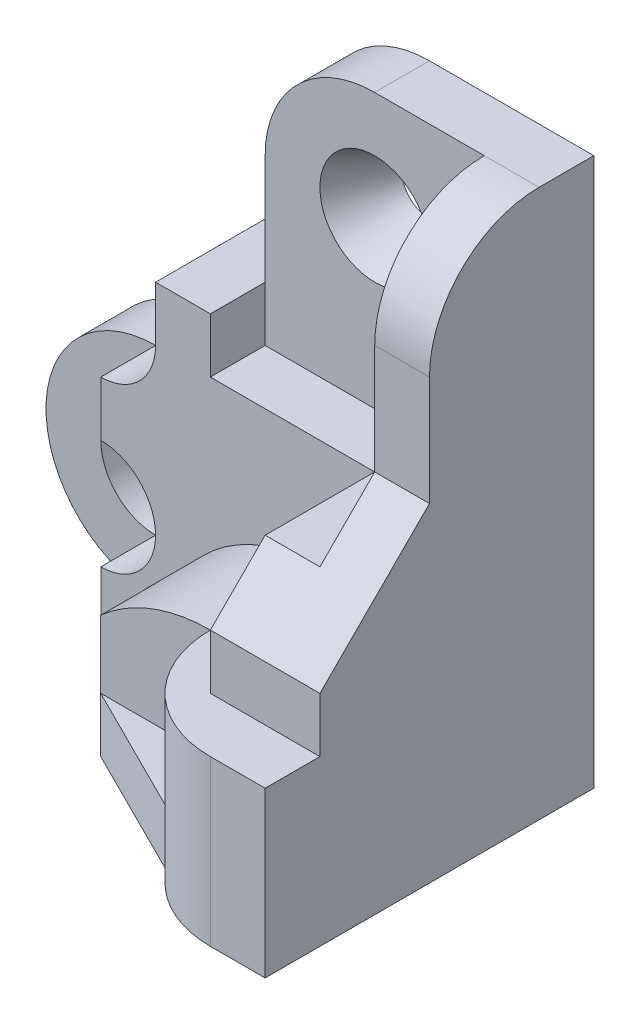
ISO-10303-21;
HEADER;
FILE_DESCRIPTION(('STEP AP214'),'2;1');
FILE_NAME('part.step','',(''),(''),'','','');
FILE_SCHEMA(('AUTOMOTIVE_DESIGN { 1 0 10303 214 1 1 1 1 }'));
ENDSEC;
DATA;
#1=APPLICATION_CONTEXT('core data for automotive mechanical design processes');
#2=APPLICATION_PROTOCOL_DEFINITION('international standard','automotive_design',2000,#1);
#3=PRODUCT_CONTEXT('',#1,'mechanical');
#4=PRODUCT('Part','Part','',(#3));
#5=PRODUCT_RELATED_PRODUCT_CATEGORY('part','',(#4));
#6=PRODUCT_DEFINITION_FORMATION('','',#4);
#7=PRODUCT_DEFINITION_CONTEXT('part definition',#1,'design');
#8=PRODUCT_DEFINITION('design','',#6,#7);
#9=PRODUCT_DEFINITION_SHAPE('','',#8);
#10=(LENGTH_UNIT() NAMED_UNIT(*) SI_UNIT(.MILLI.,.METRE.));
#11=(NAMED_UNIT(*) PLANE_ANGLE_UNIT() SI_UNIT($,.RADIAN.));
#12=(NAMED_UNIT(*) SI_UNIT($,.STERADIAN.) SOLID_ANGLE_UNIT());
#13=UNCERTAINTY_MEASURE_WITH_UNIT(LENGTH_MEASURE(1.E-05),#10,'distance_accuracy_value','');
#14=(GEOMETRIC_REPRESENTATION_CONTEXT(3) GLOBAL_UNCERTAINTY_ASSIGNED_CONTEXT((#13)) GLOBAL_UNIT_ASSIGNED_CONTEXT((#10,
#11,#12)) REPRESENTATION_CONTEXT('',''));
#15=CARTESIAN_POINT('',(0.,0.,0.));
#16=DIRECTION('',(0.,0.,1.));
#17=DIRECTION('',(1.,0.,0.));
#18=AXIS2_PLACEMENT_3D('',#15,#16,#17);
#19=CARTESIAN_POINT('',(4.,0.,6.));
#20=DIRECTION('',(0.,0.,-1.));
#21=DIRECTION('',(-1.,0.,0.));
#22=AXIS2_PLACEMENT_3D('',#19,#20,#21);
#23=CYLINDRICAL_SURFACE('',#22,3.);
#24=CARTESIAN_POINT('',(4.,0.,2.99528394795731));
#25=DIRECTION('',(0.,0.,1.));
#26=DIRECTION('',(1.,0.,0.));
#27=AXIS2_PLACEMENT_3D('',#24,#25,#26);
#28=CIRCLE('',#27,3.);
#29=CARTESIAN_POINT('',(1.9987734834733,2.23497034198452,2.99528394795731));
#30=VERTEX_POINT('',#29);
#31=CARTESIAN_POINT('',(0.999999999999999,0.,2.99528394795731));
#32=VERTEX_POINT('',#31);
#33=EDGE_CURVE('E433',#30,#32,#28,.T.);
#34=ORIENTED_EDGE('',*,*,#33,.F.);
#35=CARTESIAN_POINT('',(4.,0.,-1365.95293394664));
#36=DIRECTION('',(-0.99999893146743,0.,-0.00146187003422877));
#37=DIRECTION('',(0.00146187003422877,0.,-0.999998931467431));
#38=AXIS2_PLACEMENT_3D('',#35,#36,#37);
#39=ELLIPSE('',#38,2052.1660132275,3.);
#40=CARTESIAN_POINT('',(1.99730471761449,2.2336543165653,4.));
#41=VERTEX_POINT('',#40);
#42=EDGE_CURVE('E443',#41,#30,#39,.T.);
#43=ORIENTED_EDGE('',*,*,#42,.F.);
#44=CARTESIAN_POINT('',(4.,0.,4.));
#45=DIRECTION('',(0.,0.,-1.));
#46=DIRECTION('',(-1.,0.,0.));
#47=AXIS2_PLACEMENT_3D('',#44,#45,#46);
#48=CIRCLE('',#47,3.);
#49=CARTESIAN_POINT('',(4.,3.,4.));
#50=VERTEX_POINT('',#49);
#51=EDGE_CURVE('E274',#41,#50,#48,.T.);
#52=ORIENTED_EDGE('',*,*,#51,.T.);
#53=DIRECTION('',(0.,0.,-1.));
#54=VECTOR('',#53,1.);
#55=CARTESIAN_POINT('',(4.,3.,6.));
#56=LINE('',#55,#54);
#57=CARTESIAN_POINT('',(4.,3.,2.));
#58=VERTEX_POINT('',#57);
#59=EDGE_CURVE('E48',#50,#58,#56,.T.);
#60=ORIENTED_EDGE('',*,*,#59,.T.);
#61=CARTESIAN_POINT('',(4.,0.,2.));
#62=DIRECTION('',(0.,0.,1.));
#63=DIRECTION('',(1.,0.,0.));
#64=AXIS2_PLACEMENT_3D('',#61,#62,#63);
#65=CIRCLE('',#64,3.);
#66=CARTESIAN_POINT('',(0.999999999999999,0.,2.));
#67=VERTEX_POINT('',#66);
#68=EDGE_CURVE('E258',#58,#67,#65,.T.);
#69=ORIENTED_EDGE('',*,*,#68,.T.);
#70=DIRECTION('',(0.,0.,-1.));
#71=VECTOR('',#70,1.);
#72=CARTESIAN_POINT('',(0.999999999999999,0.,6.));
#73=LINE('',#72,#71);
#74=EDGE_CURVE('E249',#32,#67,#73,.T.);
#75=ORIENTED_EDGE('',*,*,#74,.F.);
#76=EDGE_LOOP('',(#34,#43,#52,#60,#69,#75));
#77=FACE_BOUND('',#76,.T.);
#78=ADVANCED_FACE('F33',(#77),#23,.T.);
#79=CARTESIAN_POINT('',(7.,0.,2.));
#80=DIRECTION('',(0.,1.,0.));
#81=DIRECTION('',(-1.,0.,0.));
#82=AXIS2_PLACEMENT_3D('',#79,#80,#81);
#83=PLANE('',#82);
#84=DIRECTION('',(1.,0.,0.));
#85=VECTOR('',#84,1.);
#86=CARTESIAN_POINT('',(7.,0.,2.99528394795731));
#87=LINE('',#86,#85);
#88=CARTESIAN_POINT('',(1.9987734834733,0.,2.99528394795731));
#89=VERTEX_POINT('',#88);
#90=EDGE_CURVE('E11',#32,#89,#87,.T.);
#91=ORIENTED_EDGE('',*,*,#90,.F.);
#92=ORIENTED_EDGE('',*,*,#74,.T.);
#93=DIRECTION('',(1.,0.,0.));
#94=VECTOR('',#93,1.);
#95=CARTESIAN_POINT('',(7.,0.,2.));
#96=LINE('',#95,#94);
#97=CARTESIAN_POINT('',(0.,0.,2.));
#98=VERTEX_POINT('',#97);
#99=EDGE_CURVE('E295',#98,#67,#96,.T.);
#100=ORIENTED_EDGE('',*,*,#99,.F.);
#101=DIRECTION('',(0.,0.,-1.));
#102=VECTOR('',#101,1.);
#103=CARTESIAN_POINT('',(0.,0.,2.));
#104=LINE('',#103,#102);
#105=CARTESIAN_POINT('',(0.,0.,1.));
#106=VERTEX_POINT('',#105);
#107=EDGE_CURVE('E361',#98,#106,#104,.T.);
#108=ORIENTED_EDGE('',*,*,#107,.T.);
#109=CARTESIAN_POINT('',(0.,0.,0.));
#110=VERTEX_POINT('',#109);
#111=EDGE_CURVE('E360',#106,#110,#104,.T.);
#112=ORIENTED_EDGE('',*,*,#111,.T.);
#113=DIRECTION('',(1.,0.,0.));
#114=VECTOR('',#113,1.);
#115=CARTESIAN_POINT('',(7.,0.,0.));
#116=LINE('',#115,#114);
#117=CARTESIAN_POINT('',(7.,0.,0.));
#118=VERTEX_POINT('',#117);
#119=EDGE_CURVE('E319',#110,#118,#116,.T.);
#120=ORIENTED_EDGE('',*,*,#119,.T.);
#121=DIRECTION('',(0.,0.,-1.));
#122=VECTOR('',#121,1.);
#123=CARTESIAN_POINT('',(7.,0.,2.));
#124=LINE('',#123,#122);
#125=CARTESIAN_POINT('',(7.,0.,6.));
#126=VERTEX_POINT('',#125);
#127=EDGE_CURVE('E247',#126,#118,#124,.T.);
#128=ORIENTED_EDGE('',*,*,#127,.F.);
#129=DIRECTION('',(1.,0.,0.));
#130=VECTOR('',#129,1.);
#131=CARTESIAN_POINT('',(0.999999999999999,0.,6.));
#132=LINE('',#131,#130);
#133=CARTESIAN_POINT('',(6.,0.,6.));
#134=VERTEX_POINT('',#133);
#135=EDGE_CURVE('E225',#134,#126,#132,.T.);
#136=ORIENTED_EDGE('',*,*,#135,.F.);
#137=CARTESIAN_POINT('',(6.,0.,4.));
#138=DIRECTION('',(0.,1.,0.));
#139=DIRECTION('',(-1.,0.,0.));
#140=AXIS2_PLACEMENT_3D('',#137,#138,#139);
#141=CIRCLE('',#140,2.);
#142=CARTESIAN_POINT('',(4.40064675143027,0.,5.20086185145897));
#143=VERTEX_POINT('',#142);
#144=EDGE_CURVE('E235',#143,#134,#141,.T.);
#145=ORIENTED_EDGE('',*,*,#144,.F.);
#146=DIRECTION('',(0.894547630294076,0.,0.44697263577903));
#147=VECTOR('',#146,1.);
#148=CARTESIAN_POINT('',(5.20086221429504,0.,5.60070016360141));
#149=LINE('',#148,#147);
#150=CARTESIAN_POINT('',(1.99730471761449,0.,4.));
#151=VERTEX_POINT('',#150);
#152=EDGE_CURVE('E241',#151,#143,#149,.T.);
#153=ORIENTED_EDGE('',*,*,#152,.F.);
#154=DIRECTION('',(-0.00146187003422877,0.,0.999998931467431));
#155=VECTOR('',#154,1.);
#156=CARTESIAN_POINT('',(2.00023914563881,0.,1.99269099161879));
#157=LINE('',#156,#155);
#158=EDGE_CURVE('E863',#89,#151,#157,.T.);
#159=ORIENTED_EDGE('',*,*,#158,.F.);
#160=EDGE_LOOP('',(#91,#92,#100,#108,#112,#120,#128,#136,#145,#153,#159));
#161=FACE_BOUND('',#160,.T.);
#162=ADVANCED_FACE('F245',(#161),#83,.F.);
#163=CARTESIAN_POINT('',(0.,0.999999999999999,0.));
#164=DIRECTION('',(0.,1.,0.));
#165=DIRECTION('',(0.,0.,1.));
#166=AXIS2_PLACEMENT_3D('',#163,#164,#165);
#167=PLANE('',#166);
#168=DIRECTION('',(-1.,0.,0.));
#169=VECTOR('',#168,1.);
#170=CARTESIAN_POINT('',(0.,0.999999999999999,4.));
#171=LINE('',#170,#169);
#172=CARTESIAN_POINT('',(4.,0.999999999999999,4.));
#173=VERTEX_POINT('',#172);
#174=CARTESIAN_POINT('',(1.99730471761449,0.999999999999999,4.));
#175=VERTEX_POINT('',#174);
#176=EDGE_CURVE('E231',#173,#175,#171,.T.);
#177=ORIENTED_EDGE('',*,*,#176,.T.);
#178=DIRECTION('',(0.894547630294076,0.,0.44697263577903));
#179=VECTOR('',#178,1.);
#180=CARTESIAN_POINT('',(-1.20032265004305,0.999999999999999,2.4022629043339));
#181=LINE('',#180,#179);
#182=CARTESIAN_POINT('',(4.40064675143027,0.999999999999999,5.20086185145897));
#183=VERTEX_POINT('',#182);
#184=EDGE_CURVE('E41',#175,#183,#181,.T.);
#185=ORIENTED_EDGE('',*,*,#184,.T.);
#186=CARTESIAN_POINT('',(6.,0.999999999999999,4.));
#187=DIRECTION('',(0.,1.,0.));
#188=DIRECTION('',(0.,0.,1.));
#189=AXIS2_PLACEMENT_3D('',#186,#187,#188);
#190=CIRCLE('',#189,2.);
#191=EDGE_CURVE('E440',#183,#173,#190,.F.);
#192=ORIENTED_EDGE('',*,*,#191,.T.);
#193=EDGE_LOOP('',(#177,#185,#192));
#194=FACE_BOUND('',#193,.T.);
#195=ADVANCED_FACE('F550',(#194),#167,.T.);
#196=CARTESIAN_POINT('',(4.,0.,6.));
#197=DIRECTION('',(0.,0.,1.));
#198=DIRECTION('',(1.,0.,0.));
#199=AXIS2_PLACEMENT_3D('',#196,#197,#198);
#200=PLANE('',#199);
#201=DIRECTION('',(0.,1.,0.));
#202=VECTOR('',#201,1.);
#203=CARTESIAN_POINT('',(6.,0.999999999999999,6.));
#204=LINE('',#203,#202);
#205=CARTESIAN_POINT('',(6.,3.,6.));
#206=VERTEX_POINT('',#205);
#207=EDGE_CURVE('E220',#134,#206,#204,.T.);
#208=ORIENTED_EDGE('',*,*,#207,.F.);
#209=ORIENTED_EDGE('',*,*,#135,.T.);
#210=DIRECTION('',(0.,1.,0.));
#211=VECTOR('',#210,1.);
#212=CARTESIAN_POINT('',(7.,0.,6.));
#213=LINE('',#212,#211);
#214=CARTESIAN_POINT('',(7.,3.,6.));
#215=VERTEX_POINT('',#214);
#216=EDGE_CURVE('E251',#126,#215,#213,.T.);
#217=ORIENTED_EDGE('',*,*,#216,.T.);
#218=DIRECTION('',(-1.,0.,0.));
#219=VECTOR('',#218,1.);
#220=CARTESIAN_POINT('',(5.,3.,6.));
#221=LINE('',#220,#219);
#222=EDGE_CURVE('E227',#215,#206,#221,.T.);
#223=ORIENTED_EDGE('',*,*,#222,.T.);
#224=EDGE_LOOP('',(#208,#209,#217,#223));
#225=FACE_BOUND('',#224,.T.);
#226=ADVANCED_FACE('F222',(#225),#200,.T.);
#227=CARTESIAN_POINT('',(4.,10.,2.));
#228=DIRECTION('',(0.,-1.,0.));
#229=DIRECTION('',(0.,0.,-1.));
#230=AXIS2_PLACEMENT_3D('',#227,#228,#229);
#231=PLANE('',#230);
#232=DIRECTION('',(1.,0.,0.));
#233=VECTOR('',#232,1.);
#234=CARTESIAN_POINT('',(3.,10.,1.));
#235=LINE('',#234,#233);
#236=CARTESIAN_POINT('',(6.,10.,1.));
#237=VERTEX_POINT('',#236);
#238=CARTESIAN_POINT('',(7.,10.,1.));
#239=VERTEX_POINT('',#238);
#240=EDGE_CURVE('E463',#237,#239,#235,.T.);
#241=ORIENTED_EDGE('',*,*,#240,.T.);
#242=DIRECTION('',(0.,0.,-1.));
#243=VECTOR('',#242,1.);
#244=CARTESIAN_POINT('',(7.,10.,2.));
#245=LINE('',#244,#243);
#246=CARTESIAN_POINT('',(7.,10.,0.));
#247=VERTEX_POINT('',#246);
#248=EDGE_CURVE('E357',#239,#247,#245,.T.);
#249=ORIENTED_EDGE('',*,*,#248,.T.);
#250=DIRECTION('',(-1.,0.,0.));
#251=VECTOR('',#250,1.);
#252=CARTESIAN_POINT('',(4.,10.,0.));
#253=LINE('',#252,#251);
#254=CARTESIAN_POINT('',(4.,10.,0.));
#255=VERTEX_POINT('',#254);
#256=EDGE_CURVE('E325',#247,#255,#253,.T.);
#257=ORIENTED_EDGE('',*,*,#256,.T.);
#258=DIRECTION('',(0.,0.,-1.));
#259=VECTOR('',#258,1.);
#260=CARTESIAN_POINT('',(4.,10.,2.));
#261=LINE('',#260,#259);
#262=CARTESIAN_POINT('',(4.,10.,1.));
#263=VERTEX_POINT('',#262);
#264=EDGE_CURVE('E355',#263,#255,#261,.T.);
#265=ORIENTED_EDGE('',*,*,#264,.F.);
#266=DIRECTION('',(-1.,0.,0.));
#267=VECTOR('',#266,1.);
#268=CARTESIAN_POINT('',(6.,10.,1.));
#269=LINE('',#268,#267);
#270=EDGE_CURVE('E404',#237,#263,#269,.T.);
#271=ORIENTED_EDGE('',*,*,#270,.F.);
#272=EDGE_LOOP('',(#241,#249,#257,#265,#271));
#273=FACE_BOUND('',#272,.T.);
#274=ADVANCED_FACE('F518',(#273),#231,.F.);
#275=CARTESIAN_POINT('',(0.,2.,2.));
#276=DIRECTION('',(0.,0.,-1.));
#277=DIRECTION('',(-1.,0.,0.));
#278=AXIS2_PLACEMENT_3D('',#275,#276,#277);
#279=PLANE('',#278);
#280=ORIENTED_EDGE('',*,*,#68,.F.);
#281=DIRECTION('',(-1.,0.,0.));
#282=VECTOR('',#281,1.);
#283=CARTESIAN_POINT('',(5.,3.,2.));
#284=LINE('',#283,#282);
#285=CARTESIAN_POINT('',(5.,3.,2.));
#286=VERTEX_POINT('',#285);
#287=EDGE_CURVE('E255',#286,#58,#284,.T.);
#288=ORIENTED_EDGE('',*,*,#287,.F.);
#289=DIRECTION('',(0.,-1.,0.));
#290=VECTOR('',#289,1.);
#291=CARTESIAN_POINT('',(5.,5.,2.));
#292=LINE('',#291,#290);
#293=CARTESIAN_POINT('',(5.,5.,2.));
#294=VERTEX_POINT('',#293);
#295=EDGE_CURVE('E259',#294,#286,#292,.T.);
#296=ORIENTED_EDGE('',*,*,#295,.F.);
#297=DIRECTION('',(1.,0.,0.));
#298=VECTOR('',#297,1.);
#299=CARTESIAN_POINT('',(6.,5.,2.));
#300=LINE('',#299,#298);
#301=CARTESIAN_POINT('',(2.,5.,2.));
#302=VERTEX_POINT('',#301);
#303=EDGE_CURVE('E301',#302,#294,#300,.T.);
#304=ORIENTED_EDGE('',*,*,#303,.F.);
#305=DIRECTION('',(0.,-1.,0.));
#306=VECTOR('',#305,1.);
#307=CARTESIAN_POINT('',(2.,10.,2.));
#308=LINE('',#307,#306);
#309=CARTESIAN_POINT('',(2.,6.,2.));
#310=VERTEX_POINT('',#309);
#311=EDGE_CURVE('E396',#310,#302,#308,.T.);
#312=ORIENTED_EDGE('',*,*,#311,.F.);
#313=DIRECTION('',(-1.,0.,0.));
#314=VECTOR('',#313,1.);
#315=CARTESIAN_POINT('',(0.999999999999999,6.,2.));
#316=LINE('',#315,#314);
#317=CARTESIAN_POINT('',(0.999999999999999,6.,2.));
#318=VERTEX_POINT('',#317);
#319=EDGE_CURVE('E299',#310,#318,#316,.T.);
#320=ORIENTED_EDGE('',*,*,#319,.T.);
#321=DIRECTION('',(0.,-1.,0.));
#322=VECTOR('',#321,1.);
#323=CARTESIAN_POINT('',(0.999999999999999,5.,2.));
#324=LINE('',#323,#322);
#325=CARTESIAN_POINT('',(0.999999999999999,5.,2.));
#326=VERTEX_POINT('',#325);
#327=EDGE_CURVE('E310',#318,#326,#324,.T.);
#328=ORIENTED_EDGE('',*,*,#327,.T.);
#329=CARTESIAN_POINT('',(0.,5.,2.));
#330=DIRECTION('',(0.,0.,-1.));
#331=DIRECTION('',(1.,0.,0.));
#332=AXIS2_PLACEMENT_3D('',#329,#330,#331);
#333=CIRCLE('',#332,1.);
#334=CARTESIAN_POINT('',(0.,4.,2.));
#335=VERTEX_POINT('',#334);
#336=EDGE_CURVE('E312',#326,#335,#333,.T.);
#337=ORIENTED_EDGE('',*,*,#336,.T.);
#338=DIRECTION('',(0.,1.,0.));
#339=VECTOR('',#338,1.);
#340=CARTESIAN_POINT('',(0.,4.,2.));
#341=LINE('',#340,#339);
#342=CARTESIAN_POINT('',(0.,3.,2.));
#343=VERTEX_POINT('',#342);
#344=EDGE_CURVE('E410',#343,#335,#341,.T.);
#345=ORIENTED_EDGE('',*,*,#344,.F.);
#346=CARTESIAN_POINT('',(0.,2.,2.));
#347=DIRECTION('',(0.,0.,1.));
#348=DIRECTION('',(1.,0.,0.));
#349=AXIS2_PLACEMENT_3D('',#346,#347,#348);
#350=CIRCLE('',#349,1.);
#351=CARTESIAN_POINT('',(0.,1.,2.));
#352=VERTEX_POINT('',#351);
#353=EDGE_CURVE('E320',#352,#343,#350,.T.);
#354=ORIENTED_EDGE('',*,*,#353,.F.);
#355=EDGE_CURVE('E375',#98,#352,#341,.T.);
#356=ORIENTED_EDGE('',*,*,#355,.F.);
#357=ORIENTED_EDGE('',*,*,#99,.T.);
#358=EDGE_LOOP('',(#280,#288,#296,#304,#312,#320,#328,#337,#345,#354,#356,#357));
#359=FACE_BOUND('',#358,.T.);
#360=ADVANCED_FACE('F417',(#359),#279,.F.);
#361=CARTESIAN_POINT('',(0.,2.,0.));
#362=DIRECTION('',(0.,0.,-1.));
#363=DIRECTION('',(-1.,0.,0.));
#364=AXIS2_PLACEMENT_3D('',#361,#362,#363);
#365=PLANE('',#364);
#366=CARTESIAN_POINT('',(4.,8.,0.));
#367=DIRECTION('',(0.,0.,-1.));
#368=DIRECTION('',(-1.,0.,0.));
#369=AXIS2_PLACEMENT_3D('',#366,#367,#368);
#370=CIRCLE('',#369,0.5);
#371=CARTESIAN_POINT('',(3.5,8.,0.));
#372=VERTEX_POINT('',#371);
#373=EDGE_CURVE('E869',#372,#372,#370,.T.);
#374=ORIENTED_EDGE('',*,*,#373,.F.);
#375=EDGE_LOOP('',(#374));
#376=FACE_BOUND('',#375,.T.);
#377=CARTESIAN_POINT('',(0.,2.,0.));
#378=DIRECTION('',(0.,0.,1.));
#379=DIRECTION('',(-1.,0.,0.));
#380=AXIS2_PLACEMENT_3D('',#377,#378,#379);
#381=CIRCLE('',#380,2.);
#382=CARTESIAN_POINT('',(0.,4.,0.));
#383=VERTEX_POINT('',#382);
#384=EDGE_CURVE('E316',#383,#110,#381,.T.);
#385=ORIENTED_EDGE('',*,*,#384,.F.);
#386=CARTESIAN_POINT('',(0.,5.,0.));
#387=DIRECTION('',(0.,0.,-1.));
#388=DIRECTION('',(1.,0.,0.));
#389=AXIS2_PLACEMENT_3D('',#386,#387,#388);
#390=CIRCLE('',#389,1.);
#391=CARTESIAN_POINT('',(0.999999999999999,5.,0.));
#392=VERTEX_POINT('',#391);
#393=EDGE_CURVE('E300',#392,#383,#390,.T.);
#394=ORIENTED_EDGE('',*,*,#393,.F.);
#395=DIRECTION('',(0.,-1.,0.));
#396=VECTOR('',#395,1.);
#397=CARTESIAN_POINT('',(0.999999999999999,5.,0.));
#398=LINE('',#397,#396);
#399=CARTESIAN_POINT('',(0.999999999999999,6.,0.));
#400=VERTEX_POINT('',#399);
#401=EDGE_CURVE('E336',#400,#392,#398,.T.);
#402=ORIENTED_EDGE('',*,*,#401,.F.);
#403=DIRECTION('',(-1.,0.,0.));
#404=VECTOR('',#403,1.);
#405=CARTESIAN_POINT('',(0.999999999999999,6.,0.));
#406=LINE('',#405,#404);
#407=CARTESIAN_POINT('',(2.,6.,0.));
#408=VERTEX_POINT('',#407);
#409=EDGE_CURVE('E334',#408,#400,#406,.T.);
#410=ORIENTED_EDGE('',*,*,#409,.F.);
#411=DIRECTION('',(0.,-1.,0.));
#412=VECTOR('',#411,1.);
#413=CARTESIAN_POINT('',(2.,6.,0.));
#414=LINE('',#413,#412);
#415=CARTESIAN_POINT('',(2.,8.,0.));
#416=VERTEX_POINT('',#415);
#417=EDGE_CURVE('E331',#416,#408,#414,.T.);
#418=ORIENTED_EDGE('',*,*,#417,.F.);
#419=CARTESIAN_POINT('',(4.,8.,0.));
#420=DIRECTION('',(0.,0.,1.));
#421=DIRECTION('',(-1.,0.,0.));
#422=AXIS2_PLACEMENT_3D('',#419,#420,#421);
#423=CIRCLE('',#422,2.);
#424=EDGE_CURVE('E328',#255,#416,#423,.T.);
#425=ORIENTED_EDGE('',*,*,#424,.F.);
#426=ORIENTED_EDGE('',*,*,#256,.F.);
#427=DIRECTION('',(0.,1.,0.));
#428=VECTOR('',#427,1.);
#429=CARTESIAN_POINT('',(7.,10.,0.));
#430=LINE('',#429,#428);
#431=EDGE_CURVE('E322',#118,#247,#430,.T.);
#432=ORIENTED_EDGE('',*,*,#431,.F.);
#433=ORIENTED_EDGE('',*,*,#119,.F.);
#434=EDGE_LOOP('',(#385,#394,#402,#410,#418,#425,#426,#432,#433));
#435=FACE_BOUND('',#434,.T.);
#436=CARTESIAN_POINT('',(0.,2.,0.));
#437=DIRECTION('',(0.,0.,1.));
#438=DIRECTION('',(1.,0.,0.));
#439=AXIS2_PLACEMENT_3D('',#436,#437,#438);
#440=CIRCLE('',#439,1.);
#441=CARTESIAN_POINT('',(1.,2.,0.));
#442=VERTEX_POINT('',#441);
#443=EDGE_CURVE('E307',#442,#442,#440,.T.);
#444=ORIENTED_EDGE('',*,*,#443,.T.);
#445=EDGE_LOOP('',(#444));
#446=FACE_BOUND('',#445,.T.);
#447=ADVANCED_FACE('F510',(#376,#435,#446),#365,.T.);
#448=CARTESIAN_POINT('',(0.,2.,2.));
#449=DIRECTION('',(0.,0.,-1.));
#450=DIRECTION('',(-1.,0.,0.));
#451=AXIS2_PLACEMENT_3D('',#448,#449,#450);
#452=CYLINDRICAL_SURFACE('',#451,2.);
#453=ORIENTED_EDGE('',*,*,#111,.F.);
#454=CARTESIAN_POINT('',(0.,2.,1.));
#455=DIRECTION('',(0.,0.,-1.));
#456=DIRECTION('',(-1.,0.,0.));
#457=AXIS2_PLACEMENT_3D('',#454,#455,#456);
#458=CIRCLE('',#457,2.);
#459=CARTESIAN_POINT('',(0.,4.,1.));
#460=VERTEX_POINT('',#459);
#461=EDGE_CURVE('E398',#106,#460,#458,.T.);
#462=ORIENTED_EDGE('',*,*,#461,.T.);
#463=DIRECTION('',(0.,0.,-1.));
#464=VECTOR('',#463,1.);
#465=CARTESIAN_POINT('',(0.,4.,2.));
#466=LINE('',#465,#464);
#467=EDGE_CURVE('E315',#460,#383,#466,.T.);
#468=ORIENTED_EDGE('',*,*,#467,.T.);
#469=ORIENTED_EDGE('',*,*,#384,.T.);
#470=EDGE_LOOP('',(#453,#462,#468,#469));
#471=FACE_BOUND('',#470,.T.);
#472=ADVANCED_FACE('F35',(#471),#452,.T.);
#473=CARTESIAN_POINT('',(7.,10.,2.));
#474=DIRECTION('',(-1.,0.,0.));
#475=DIRECTION('',(0.,-1.,0.));
#476=AXIS2_PLACEMENT_3D('',#473,#474,#475);
#477=PLANE('',#476);
#478=ORIENTED_EDGE('',*,*,#248,.F.);
#479=CARTESIAN_POINT('',(7.,8.,1.));
#480=DIRECTION('',(-1.,0.,0.));
#481=DIRECTION('',(0.,1.,0.));
#482=AXIS2_PLACEMENT_3D('',#479,#480,#481);
#483=CIRCLE('',#482,2.);
#484=CARTESIAN_POINT('',(7.,8.,3.));
#485=VERTEX_POINT('',#484);
#486=EDGE_CURVE('E449',#485,#239,#483,.T.);
#487=ORIENTED_EDGE('',*,*,#486,.F.);
#488=DIRECTION('',(0.,1.,0.));
#489=VECTOR('',#488,1.);
#490=CARTESIAN_POINT('',(7.,8.,3.));
#491=LINE('',#490,#489);
#492=CARTESIAN_POINT('',(7.,6.,3.));
#493=VERTEX_POINT('',#492);
#494=EDGE_CURVE('E460',#493,#485,#491,.T.);
#495=ORIENTED_EDGE('',*,*,#494,.F.);
#496=DIRECTION('',(0.,0.707106781186548,-0.707106781186547));
#497=VECTOR('',#496,1.);
#498=CARTESIAN_POINT('',(7.,6.,3.));
#499=LINE('',#498,#497);
#500=CARTESIAN_POINT('',(7.,4.,5.));
#501=VERTEX_POINT('',#500);
#502=EDGE_CURVE('E457',#501,#493,#499,.T.);
#503=ORIENTED_EDGE('',*,*,#502,.F.);
#504=DIRECTION('',(0.,1.,0.));
#505=VECTOR('',#504,1.);
#506=CARTESIAN_POINT('',(7.,4.,5.));
#507=LINE('',#506,#505);
#508=CARTESIAN_POINT('',(7.,3.,5.));
#509=VERTEX_POINT('',#508);
#510=EDGE_CURVE('E454',#509,#501,#507,.T.);
#511=ORIENTED_EDGE('',*,*,#510,.F.);
#512=DIRECTION('',(0.,0.,-1.));
#513=VECTOR('',#512,1.);
#514=CARTESIAN_POINT('',(7.,3.,5.));
#515=LINE('',#514,#513);
#516=EDGE_CURVE('E452',#215,#509,#515,.T.);
#517=ORIENTED_EDGE('',*,*,#516,.F.);
#518=ORIENTED_EDGE('',*,*,#216,.F.);
#519=ORIENTED_EDGE('',*,*,#127,.T.);
#520=ORIENTED_EDGE('',*,*,#431,.T.);
#521=EDGE_LOOP('',(#478,#487,#495,#503,#511,#517,#518,#519,#520));
#522=FACE_BOUND('',#521,.T.);
#523=ADVANCED_FACE('F483',(#522),#477,.F.);
#524=CARTESIAN_POINT('',(4.,8.,2.));
#525=DIRECTION('',(0.,0.,-1.));
#526=DIRECTION('',(-1.,0.,0.));
#527=AXIS2_PLACEMENT_3D('',#524,#525,#526);
#528=CYLINDRICAL_SURFACE('',#527,2.);
#529=DIRECTION('',(0.,0.,-1.));
#530=VECTOR('',#529,1.);
#531=CARTESIAN_POINT('',(2.,8.,2.));
#532=LINE('',#531,#530);
#533=CARTESIAN_POINT('',(2.,8.,1.));
#534=VERTEX_POINT('',#533);
#535=EDGE_CURVE('E353',#534,#416,#532,.T.);
#536=ORIENTED_EDGE('',*,*,#535,.F.);
#537=CARTESIAN_POINT('',(4.,8.,1.));
#538=DIRECTION('',(0.,0.,-1.));
#539=DIRECTION('',(-1.,0.,0.));
#540=AXIS2_PLACEMENT_3D('',#537,#538,#539);
#541=CIRCLE('',#540,2.);
#542=EDGE_CURVE('E384',#534,#263,#541,.T.);
#543=ORIENTED_EDGE('',*,*,#542,.T.);
#544=ORIENTED_EDGE('',*,*,#264,.T.);
#545=ORIENTED_EDGE('',*,*,#424,.T.);
#546=EDGE_LOOP('',(#536,#543,#544,#545));
#547=FACE_BOUND('',#546,.T.);
#548=ADVANCED_FACE('F534',(#547),#528,.T.);
#549=CARTESIAN_POINT('',(2.,6.,2.));
#550=DIRECTION('',(1.,0.,0.));
#551=DIRECTION('',(0.,0.,-1.));
#552=AXIS2_PLACEMENT_3D('',#549,#550,#551);
#553=PLANE('',#552);
#554=DIRECTION('',(0.,0.,-1.));
#555=VECTOR('',#554,1.);
#556=CARTESIAN_POINT('',(2.,6.,2.));
#557=LINE('',#556,#555);
#558=CARTESIAN_POINT('',(2.,6.,1.));
#559=VERTEX_POINT('',#558);
#560=EDGE_CURVE('E349',#559,#408,#557,.T.);
#561=ORIENTED_EDGE('',*,*,#560,.F.);
#562=DIRECTION('',(0.,-1.,0.));
#563=VECTOR('',#562,1.);
#564=CARTESIAN_POINT('',(2.,10.,1.));
#565=LINE('',#564,#563);
#566=EDGE_CURVE('E401',#534,#559,#565,.T.);
#567=ORIENTED_EDGE('',*,*,#566,.F.);
#568=ORIENTED_EDGE('',*,*,#535,.T.);
#569=ORIENTED_EDGE('',*,*,#417,.T.);
#570=EDGE_LOOP('',(#561,#567,#568,#569));
#571=FACE_BOUND('',#570,.T.);
#572=ADVANCED_FACE('F532',(#571),#553,.F.);
#573=CARTESIAN_POINT('',(0.999999999999999,6.,2.));
#574=DIRECTION('',(0.,-1.,0.));
#575=DIRECTION('',(0.,0.,-1.));
#576=AXIS2_PLACEMENT_3D('',#573,#574,#575);
#577=PLANE('',#576);
#578=ORIENTED_EDGE('',*,*,#409,.T.);
#579=DIRECTION('',(0.,0.,-1.));
#580=VECTOR('',#579,1.);
#581=CARTESIAN_POINT('',(0.999999999999999,6.,2.));
#582=LINE('',#581,#580);
#583=EDGE_CURVE('E346',#318,#400,#582,.T.);
#584=ORIENTED_EDGE('',*,*,#583,.F.);
#585=ORIENTED_EDGE('',*,*,#319,.F.);
#586=EDGE_CURVE('E350',#310,#559,#557,.T.);
#587=ORIENTED_EDGE('',*,*,#586,.T.);
#588=ORIENTED_EDGE('',*,*,#560,.T.);
#589=EDGE_LOOP('',(#578,#584,#585,#587,#588));
#590=FACE_BOUND('',#589,.T.);
#591=ADVANCED_FACE('F504',(#590),#577,.F.);
#592=CARTESIAN_POINT('',(0.999999999999999,5.,2.));
#593=DIRECTION('',(1.,0.,0.));
#594=DIRECTION('',(0.,0.,-1.));
#595=AXIS2_PLACEMENT_3D('',#592,#593,#594);
#596=PLANE('',#595);
#597=ORIENTED_EDGE('',*,*,#401,.T.);
#598=DIRECTION('',(0.,0.,-1.));
#599=VECTOR('',#598,1.);
#600=CARTESIAN_POINT('',(0.999999999999999,5.,2.));
#601=LINE('',#600,#599);
#602=EDGE_CURVE('E343',#326,#392,#601,.T.);
#603=ORIENTED_EDGE('',*,*,#602,.F.);
#604=ORIENTED_EDGE('',*,*,#327,.F.);
#605=ORIENTED_EDGE('',*,*,#583,.T.);
#606=EDGE_LOOP('',(#597,#603,#604,#605));
#607=FACE_BOUND('',#606,.T.);
#608=ADVANCED_FACE('F508',(#607),#596,.F.);
#609=CARTESIAN_POINT('',(0.,5.,2.));
#610=DIRECTION('',(0.,0.,-1.));
#611=DIRECTION('',(-1.,0.,0.));
#612=AXIS2_PLACEMENT_3D('',#609,#610,#611);
#613=CYLINDRICAL_SURFACE('',#612,1.);
#614=ORIENTED_EDGE('',*,*,#393,.T.);
#615=ORIENTED_EDGE('',*,*,#467,.F.);
#616=EDGE_CURVE('E340',#335,#460,#466,.T.);
#617=ORIENTED_EDGE('',*,*,#616,.F.);
#618=ORIENTED_EDGE('',*,*,#336,.F.);
#619=ORIENTED_EDGE('',*,*,#602,.T.);
#620=EDGE_LOOP('',(#614,#615,#617,#618,#619));
#621=FACE_BOUND('',#620,.T.);
#622=ADVANCED_FACE('F422',(#621),#613,.F.);
#623=CARTESIAN_POINT('',(0.,2.,2.));
#624=DIRECTION('',(0.,0.,-1.));
#625=DIRECTION('',(-1.,0.,0.));
#626=AXIS2_PLACEMENT_3D('',#623,#624,#625);
#627=CYLINDRICAL_SURFACE('',#626,1.);
#628=DIRECTION('',(0.,0.,-1.));
#629=VECTOR('',#628,1.);
#630=CARTESIAN_POINT('',(0.,1.,2.));
#631=LINE('',#630,#629);
#632=CARTESIAN_POINT('',(0.,1.,1.));
#633=VERTEX_POINT('',#632);
#634=EDGE_CURVE('E282',#352,#633,#631,.T.);
#635=ORIENTED_EDGE('',*,*,#634,.F.);
#636=ORIENTED_EDGE('',*,*,#353,.T.);
#637=DIRECTION('',(0.,0.,-1.));
#638=VECTOR('',#637,1.);
#639=CARTESIAN_POINT('',(0.,3.,2.));
#640=LINE('',#639,#638);
#641=CARTESIAN_POINT('',(0.,3.,1.));
#642=VERTEX_POINT('',#641);
#643=EDGE_CURVE('E285',#642,#343,#640,.F.);
#644=ORIENTED_EDGE('',*,*,#643,.F.);
#645=CARTESIAN_POINT('',(0.,2.,1.));
#646=DIRECTION('',(0.,0.,-1.));
#647=DIRECTION('',(-1.,0.,0.));
#648=AXIS2_PLACEMENT_3D('',#645,#646,#647);
#649=CIRCLE('',#648,1.);
#650=EDGE_CURVE('E291',#633,#642,#649,.T.);
#651=ORIENTED_EDGE('',*,*,#650,.F.);
#652=EDGE_LOOP('',(#635,#636,#644,#651));
#653=FACE_BOUND('',#652,.T.);
#654=ORIENTED_EDGE('',*,*,#443,.F.);
#655=EDGE_LOOP('',(#654));
#656=FACE_BOUND('',#655,.T.);
#657=ADVANCED_FACE('F378',(#653,#656),#627,.F.);
#658=CARTESIAN_POINT('',(0.,0.,1.));
#659=DIRECTION('',(0.,0.,-1.));
#660=DIRECTION('',(-1.,0.,0.));
#661=AXIS2_PLACEMENT_3D('',#658,#659,#660);
#662=PLANE('',#661);
#663=CARTESIAN_POINT('',(4.,8.,1.));
#664=DIRECTION('',(0.,0.,-1.));
#665=DIRECTION('',(-1.,0.,0.));
#666=AXIS2_PLACEMENT_3D('',#663,#664,#665);
#667=CIRCLE('',#666,0.999999999999999);
#668=CARTESIAN_POINT('',(3.,8.,1.));
#669=VERTEX_POINT('',#668);
#670=EDGE_CURVE('E874',#669,#669,#667,.T.);
#671=ORIENTED_EDGE('',*,*,#670,.T.);
#672=EDGE_LOOP('',(#671));
#673=FACE_BOUND('',#672,.T.);
#674=ORIENTED_EDGE('',*,*,#566,.T.);
#675=CARTESIAN_POINT('',(2.,5.,1.));
#676=VERTEX_POINT('',#675);
#677=EDGE_CURVE('E402',#559,#676,#565,.T.);
#678=ORIENTED_EDGE('',*,*,#677,.T.);
#679=DIRECTION('',(1.,0.,0.));
#680=VECTOR('',#679,1.);
#681=CARTESIAN_POINT('',(6.,5.,1.));
#682=LINE('',#681,#680);
#683=CARTESIAN_POINT('',(6.,5.,1.));
#684=VERTEX_POINT('',#683);
#685=EDGE_CURVE('E392',#676,#684,#682,.T.);
#686=ORIENTED_EDGE('',*,*,#685,.T.);
#687=DIRECTION('',(0.,1.,0.));
#688=VECTOR('',#687,1.);
#689=CARTESIAN_POINT('',(6.,10.,1.));
#690=LINE('',#689,#688);
#691=EDGE_CURVE('E406',#684,#237,#690,.T.);
#692=ORIENTED_EDGE('',*,*,#691,.T.);
#693=ORIENTED_EDGE('',*,*,#270,.T.);
#694=ORIENTED_EDGE('',*,*,#542,.F.);
#695=EDGE_LOOP('',(#674,#678,#686,#692,#693,#694));
#696=FACE_BOUND('',#695,.T.);
#697=ADVANCED_FACE('F528',(#673,#696),#662,.F.);
#698=CARTESIAN_POINT('',(2.,10.,1.));
#699=DIRECTION('',(-1.,0.,0.));
#700=DIRECTION('',(0.,-1.,0.));
#701=AXIS2_PLACEMENT_3D('',#698,#699,#700);
#702=PLANE('',#701);
#703=ORIENTED_EDGE('',*,*,#311,.T.);
#704=DIRECTION('',(0.,0.,1.));
#705=VECTOR('',#704,1.);
#706=CARTESIAN_POINT('',(2.,5.,1.));
#707=LINE('',#706,#705);
#708=EDGE_CURVE('E389',#676,#302,#707,.T.);
#709=ORIENTED_EDGE('',*,*,#708,.F.);
#710=ORIENTED_EDGE('',*,*,#677,.F.);
#711=ORIENTED_EDGE('',*,*,#586,.F.);
#712=EDGE_LOOP('',(#703,#709,#710,#711));
#713=FACE_BOUND('',#712,.T.);
#714=ADVANCED_FACE('F499',(#713),#702,.F.);
#715=CARTESIAN_POINT('',(6.,10.,1.));
#716=DIRECTION('',(1.,0.,0.));
#717=DIRECTION('',(0.,1.,0.));
#718=AXIS2_PLACEMENT_3D('',#715,#716,#717);
#719=PLANE('',#718);
#720=DIRECTION('',(0.,1.,0.));
#721=VECTOR('',#720,1.);
#722=CARTESIAN_POINT('',(6.,10.,3.));
#723=LINE('',#722,#721);
#724=CARTESIAN_POINT('',(6.,6.,3.));
#725=VERTEX_POINT('',#724);
#726=CARTESIAN_POINT('',(6.,8.,3.));
#727=VERTEX_POINT('',#726);
#728=EDGE_CURVE('E279',#725,#727,#723,.T.);
#729=ORIENTED_EDGE('',*,*,#728,.T.);
#730=CARTESIAN_POINT('',(6.,8.,1.));
#731=DIRECTION('',(1.,0.,0.));
#732=DIRECTION('',(0.,1.,0.));
#733=AXIS2_PLACEMENT_3D('',#730,#731,#732);
#734=CIRCLE('',#733,2.);
#735=EDGE_CURVE('E276',#727,#237,#734,.F.);
#736=ORIENTED_EDGE('',*,*,#735,.T.);
#737=ORIENTED_EDGE('',*,*,#691,.F.);
#738=DIRECTION('',(0.,0.,1.));
#739=VECTOR('',#738,1.);
#740=CARTESIAN_POINT('',(6.,5.,1.));
#741=LINE('',#740,#739);
#742=CARTESIAN_POINT('',(6.,5.,4.));
#743=VERTEX_POINT('',#742);
#744=EDGE_CURVE('E388',#684,#743,#741,.T.);
#745=ORIENTED_EDGE('',*,*,#744,.T.);
#746=DIRECTION('',(0.,0.707106781186548,-0.707106781186547));
#747=VECTOR('',#746,1.);
#748=CARTESIAN_POINT('',(6.,9.,0.));
#749=LINE('',#748,#747);
#750=EDGE_CURVE('E479',#743,#725,#749,.T.);
#751=ORIENTED_EDGE('',*,*,#750,.T.);
#752=EDGE_LOOP('',(#729,#736,#737,#745,#751));
#753=FACE_BOUND('',#752,.T.);
#754=ADVANCED_FACE('F526',(#753),#719,.F.);
#755=CARTESIAN_POINT('',(6.,5.,1.));
#756=DIRECTION('',(0.,-1.,0.));
#757=DIRECTION('',(1.,0.,0.));
#758=AXIS2_PLACEMENT_3D('',#755,#756,#757);
#759=PLANE('',#758);
#760=DIRECTION('',(0.,0.,-1.));
#761=VECTOR('',#760,1.);
#762=CARTESIAN_POINT('',(5.,5.,6.));
#763=LINE('',#762,#761);
#764=CARTESIAN_POINT('',(5.,5.,4.));
#765=VERTEX_POINT('',#764);
#766=EDGE_CURVE('E56',#765,#294,#763,.T.);
#767=ORIENTED_EDGE('',*,*,#766,.F.);
#768=DIRECTION('',(1.,0.,0.));
#769=VECTOR('',#768,1.);
#770=CARTESIAN_POINT('',(6.,5.,4.));
#771=LINE('',#770,#769);
#772=EDGE_CURVE('E476',#765,#743,#771,.T.);
#773=ORIENTED_EDGE('',*,*,#772,.T.);
#774=ORIENTED_EDGE('',*,*,#744,.F.);
#775=ORIENTED_EDGE('',*,*,#685,.F.);
#776=ORIENTED_EDGE('',*,*,#708,.T.);
#777=ORIENTED_EDGE('',*,*,#303,.T.);
#778=EDGE_LOOP('',(#767,#773,#774,#775,#776,#777));
#779=FACE_BOUND('',#778,.T.);
#780=ADVANCED_FACE('F494',(#779),#759,.F.);
#781=CARTESIAN_POINT('',(0.,4.,1.));
#782=DIRECTION('',(1.,0.,0.));
#783=DIRECTION('',(0.,0.,-1.));
#784=AXIS2_PLACEMENT_3D('',#781,#782,#783);
#785=PLANE('',#784);
#786=ORIENTED_EDGE('',*,*,#634,.T.);
#787=DIRECTION('',(0.,1.,0.));
#788=VECTOR('',#787,1.);
#789=CARTESIAN_POINT('',(0.,4.,1.));
#790=LINE('',#789,#788);
#791=EDGE_CURVE('E367',#106,#633,#790,.T.);
#792=ORIENTED_EDGE('',*,*,#791,.F.);
#793=ORIENTED_EDGE('',*,*,#107,.F.);
#794=ORIENTED_EDGE('',*,*,#355,.T.);
#795=EDGE_LOOP('',(#786,#792,#793,#794));
#796=FACE_BOUND('',#795,.T.);
#797=ADVANCED_FACE('F427',(#796),#785,.F.);
#798=CARTESIAN_POINT('',(0.,0.,1.));
#799=DIRECTION('',(0.,0.,-1.));
#800=DIRECTION('',(-1.,0.,0.));
#801=AXIS2_PLACEMENT_3D('',#798,#799,#800);
#802=PLANE('',#801);
#803=ORIENTED_EDGE('',*,*,#791,.T.);
#804=ORIENTED_EDGE('',*,*,#650,.T.);
#805=EDGE_CURVE('E366',#642,#460,#790,.T.);
#806=ORIENTED_EDGE('',*,*,#805,.T.);
#807=ORIENTED_EDGE('',*,*,#461,.F.);
#808=EDGE_LOOP('',(#803,#804,#806,#807));
#809=FACE_BOUND('',#808,.T.);
#810=ADVANCED_FACE('F365',(#809),#802,.F.);
#811=ORIENTED_EDGE('',*,*,#643,.T.);
#812=ORIENTED_EDGE('',*,*,#344,.T.);
#813=ORIENTED_EDGE('',*,*,#616,.T.);
#814=ORIENTED_EDGE('',*,*,#805,.F.);
#815=EDGE_LOOP('',(#811,#812,#813,#814));
#816=FACE_BOUND('',#815,.T.);
#817=ADVANCED_FACE('F371',(#816),#785,.F.);
#818=CARTESIAN_POINT('',(5.,5.,6.));
#819=DIRECTION('',(1.,0.,0.));
#820=DIRECTION('',(0.,0.,-1.));
#821=AXIS2_PLACEMENT_3D('',#818,#819,#820);
#822=PLANE('',#821);
#823=DIRECTION('',(0.,1.,0.));
#824=VECTOR('',#823,1.);
#825=CARTESIAN_POINT('',(5.,5.,5.));
#826=LINE('',#825,#824);
#827=CARTESIAN_POINT('',(5.,3.,5.));
#828=VERTEX_POINT('',#827);
#829=CARTESIAN_POINT('',(5.,4.,5.));
#830=VERTEX_POINT('',#829);
#831=EDGE_CURVE('E466',#828,#830,#826,.T.);
#832=ORIENTED_EDGE('',*,*,#831,.T.);
#833=DIRECTION('',(0.,0.707106781186548,-0.707106781186547));
#834=VECTOR('',#833,1.);
#835=CARTESIAN_POINT('',(5.,4.,5.));
#836=LINE('',#835,#834);
#837=EDGE_CURVE('E281',#830,#765,#836,.T.);
#838=ORIENTED_EDGE('',*,*,#837,.T.);
#839=ORIENTED_EDGE('',*,*,#766,.T.);
#840=ORIENTED_EDGE('',*,*,#295,.T.);
#841=DIRECTION('',(0.,0.,-1.));
#842=VECTOR('',#841,1.);
#843=CARTESIAN_POINT('',(5.,3.,6.));
#844=LINE('',#843,#842);
#845=EDGE_CURVE('E411',#828,#286,#844,.T.);
#846=ORIENTED_EDGE('',*,*,#845,.F.);
#847=EDGE_LOOP('',(#832,#838,#839,#840,#846));
#848=FACE_BOUND('',#847,.T.);
#849=ADVANCED_FACE('F488',(#848),#822,.F.);
#850=CARTESIAN_POINT('',(5.,3.,6.));
#851=DIRECTION('',(0.,-1.,0.));
#852=DIRECTION('',(0.,0.,-1.));
#853=AXIS2_PLACEMENT_3D('',#850,#851,#852);
#854=PLANE('',#853);
#855=ORIENTED_EDGE('',*,*,#59,.F.);
#856=CARTESIAN_POINT('',(6.,3.,4.));
#857=DIRECTION('',(0.,1.,0.));
#858=DIRECTION('',(0.,0.,1.));
#859=AXIS2_PLACEMENT_3D('',#856,#857,#858);
#860=CIRCLE('',#859,2.);
#861=EDGE_CURVE('E435',#206,#50,#860,.F.);
#862=ORIENTED_EDGE('',*,*,#861,.F.);
#863=ORIENTED_EDGE('',*,*,#222,.F.);
#864=ORIENTED_EDGE('',*,*,#516,.T.);
#865=DIRECTION('',(1.,0.,0.));
#866=VECTOR('',#865,1.);
#867=CARTESIAN_POINT('',(3.,3.,5.));
#868=LINE('',#867,#866);
#869=EDGE_CURVE('E471',#828,#509,#868,.T.);
#870=ORIENTED_EDGE('',*,*,#869,.F.);
#871=ORIENTED_EDGE('',*,*,#845,.T.);
#872=ORIENTED_EDGE('',*,*,#287,.T.);
#873=EDGE_LOOP('',(#855,#862,#863,#864,#870,#871,#872));
#874=FACE_BOUND('',#873,.T.);
#875=ADVANCED_FACE('F434',(#874),#854,.F.);
#876=CARTESIAN_POINT('',(3.,8.,1.));
#877=DIRECTION('',(1.,0.,0.));
#878=DIRECTION('',(0.,1.,0.));
#879=AXIS2_PLACEMENT_3D('',#876,#877,#878);
#880=CYLINDRICAL_SURFACE('',#879,2.);
#881=DIRECTION('',(1.,0.,0.));
#882=VECTOR('',#881,1.);
#883=CARTESIAN_POINT('',(3.,8.,3.));
#884=LINE('',#883,#882);
#885=EDGE_CURVE('E464',#727,#485,#884,.T.);
#886=ORIENTED_EDGE('',*,*,#885,.T.);
#887=ORIENTED_EDGE('',*,*,#486,.T.);
#888=ORIENTED_EDGE('',*,*,#240,.F.);
#889=ORIENTED_EDGE('',*,*,#735,.F.);
#890=EDGE_LOOP('',(#886,#887,#888,#889));
#891=FACE_BOUND('',#890,.T.);
#892=ADVANCED_FACE('F522',(#891),#880,.T.);
#893=CARTESIAN_POINT('',(3.,8.,3.));
#894=DIRECTION('',(0.,0.,-1.));
#895=DIRECTION('',(-1.,0.,0.));
#896=AXIS2_PLACEMENT_3D('',#893,#894,#895);
#897=PLANE('',#896);
#898=DIRECTION('',(1.,0.,0.));
#899=VECTOR('',#898,1.);
#900=CARTESIAN_POINT('',(3.,6.,3.));
#901=LINE('',#900,#899);
#902=EDGE_CURVE('E467',#725,#493,#901,.T.);
#903=ORIENTED_EDGE('',*,*,#902,.T.);
#904=ORIENTED_EDGE('',*,*,#494,.T.);
#905=ORIENTED_EDGE('',*,*,#885,.F.);
#906=ORIENTED_EDGE('',*,*,#728,.F.);
#907=EDGE_LOOP('',(#903,#904,#905,#906));
#908=FACE_BOUND('',#907,.T.);
#909=ADVANCED_FACE('F650',(#908),#897,.F.);
#910=CARTESIAN_POINT('',(3.,6.,3.));
#911=DIRECTION('',(0.,-0.707106781186547,-0.707106781186548));
#912=DIRECTION('',(0.,0.707106781186548,-0.707106781186547));
#913=AXIS2_PLACEMENT_3D('',#910,#911,#912);
#914=PLANE('',#913);
#915=ORIENTED_EDGE('',*,*,#772,.F.);
#916=ORIENTED_EDGE('',*,*,#837,.F.);
#917=DIRECTION('',(1.,0.,0.));
#918=VECTOR('',#917,1.);
#919=CARTESIAN_POINT('',(3.,4.,5.));
#920=LINE('',#919,#918);
#921=EDGE_CURVE('E469',#830,#501,#920,.T.);
#922=ORIENTED_EDGE('',*,*,#921,.T.);
#923=ORIENTED_EDGE('',*,*,#502,.T.);
#924=ORIENTED_EDGE('',*,*,#902,.F.);
#925=ORIENTED_EDGE('',*,*,#750,.F.);
#926=EDGE_LOOP('',(#915,#916,#922,#923,#924,#925));
#927=FACE_BOUND('',#926,.T.);
#928=ADVANCED_FACE('F656',(#927),#914,.F.);
#929=CARTESIAN_POINT('',(3.,4.,5.));
#930=DIRECTION('',(0.,0.,-1.));
#931=DIRECTION('',(-1.,0.,0.));
#932=AXIS2_PLACEMENT_3D('',#929,#930,#931);
#933=PLANE('',#932);
#934=ORIENTED_EDGE('',*,*,#869,.T.);
#935=ORIENTED_EDGE('',*,*,#510,.T.);
#936=ORIENTED_EDGE('',*,*,#921,.F.);
#937=ORIENTED_EDGE('',*,*,#831,.F.);
#938=EDGE_LOOP('',(#934,#935,#936,#937));
#939=FACE_BOUND('',#938,.T.);
#940=ADVANCED_FACE('F664',(#939),#933,.F.);
#941=CARTESIAN_POINT('',(0.,0.999999999999999,4.));
#942=DIRECTION('',(0.,0.,-1.));
#943=DIRECTION('',(-1.,0.,0.));
#944=AXIS2_PLACEMENT_3D('',#941,#942,#943);
#945=PLANE('',#944);
#946=DIRECTION('',(0.,1.,0.));
#947=VECTOR('',#946,1.);
#948=CARTESIAN_POINT('',(1.99730471761449,0.999999999999999,4.));
#949=LINE('',#948,#947);
#950=EDGE_CURVE('E447',#175,#41,#949,.T.);
#951=ORIENTED_EDGE('',*,*,#950,.F.);
#952=ORIENTED_EDGE('',*,*,#176,.F.);
#953=DIRECTION('',(0.,1.,0.));
#954=VECTOR('',#953,1.);
#955=CARTESIAN_POINT('',(4.,0.999999999999999,4.));
#956=LINE('',#955,#954);
#957=EDGE_CURVE('E230',#173,#50,#956,.T.);
#958=ORIENTED_EDGE('',*,*,#957,.T.);
#959=ORIENTED_EDGE('',*,*,#51,.F.);
#960=EDGE_LOOP('',(#951,#952,#958,#959));
#961=FACE_BOUND('',#960,.T.);
#962=ADVANCED_FACE('F672',(#961),#945,.F.);
#963=CARTESIAN_POINT('',(6.,0.999999999999999,4.));
#964=DIRECTION('',(0.,1.,0.));
#965=DIRECTION('',(0.,0.,1.));
#966=AXIS2_PLACEMENT_3D('',#963,#964,#965);
#967=CYLINDRICAL_SURFACE('',#966,2.);
#968=ORIENTED_EDGE('',*,*,#861,.T.);
#969=ORIENTED_EDGE('',*,*,#957,.F.);
#970=ORIENTED_EDGE('',*,*,#191,.F.);
#971=DIRECTION('',(0.,1.,0.));
#972=VECTOR('',#971,1.);
#973=CARTESIAN_POINT('',(4.40064675143027,-9.,5.20086185145897));
#974=LINE('',#973,#972);
#975=EDGE_CURVE('E238',#143,#183,#974,.T.);
#976=ORIENTED_EDGE('',*,*,#975,.F.);
#977=ORIENTED_EDGE('',*,*,#144,.T.);
#978=ORIENTED_EDGE('',*,*,#207,.T.);
#979=EDGE_LOOP('',(#968,#969,#970,#976,#977,#978));
#980=FACE_BOUND('',#979,.T.);
#981=ADVANCED_FACE('F236',(#980),#967,.T.);
#982=CARTESIAN_POINT('',(0.,-9.,2.99528394795731));
#983=DIRECTION('',(0.,0.,1.));
#984=DIRECTION('',(1.,0.,0.));
#985=AXIS2_PLACEMENT_3D('',#982,#983,#984);
#986=PLANE('',#985);
#987=ORIENTED_EDGE('',*,*,#33,.T.);
#988=ORIENTED_EDGE('',*,*,#90,.T.);
#989=DIRECTION('',(0.,1.,0.));
#990=VECTOR('',#989,1.);
#991=CARTESIAN_POINT('',(1.9987734834733,-9.,2.99528394795731));
#992=LINE('',#991,#990);
#993=EDGE_CURVE('E242',#89,#30,#992,.T.);
#994=ORIENTED_EDGE('',*,*,#993,.T.);
#995=EDGE_LOOP('',(#987,#988,#994));
#996=FACE_BOUND('',#995,.T.);
#997=ADVANCED_FACE('F685',(#996),#986,.T.);
#998=CARTESIAN_POINT('',(2.00314792313518,-9.,0.00292834505199096));
#999=DIRECTION('',(-0.99999893146743,0.,-0.00146187003422877));
#1000=DIRECTION('',(-0.00146187003422877,0.,0.999998931467431));
#1001=AXIS2_PLACEMENT_3D('',#998,#999,#1000);
#1002=PLANE('',#1001);
#1003=ORIENTED_EDGE('',*,*,#42,.T.);
#1004=ORIENTED_EDGE('',*,*,#993,.F.);
#1005=ORIENTED_EDGE('',*,*,#158,.T.);
#1006=DIRECTION('',(0.,1.,0.));
#1007=VECTOR('',#1006,1.);
#1008=CARTESIAN_POINT('',(1.99730471761449,-9.,4.));
#1009=LINE('',#1008,#1007);
#1010=EDGE_CURVE('E862',#151,#175,#1009,.T.);
#1011=ORIENTED_EDGE('',*,*,#1010,.T.);
#1012=ORIENTED_EDGE('',*,*,#950,.T.);
#1013=EDGE_LOOP('',(#1003,#1004,#1005,#1011,#1012));
#1014=FACE_BOUND('',#1013,.T.);
#1015=ADVANCED_FACE('F692',(#1014),#1002,.T.);
#1016=CARTESIAN_POINT('',(-1.20032265004305,-9.,2.4022629043339));
#1017=DIRECTION('',(-0.44697263577903,0.,0.894547630294076));
#1018=DIRECTION('',(0.894547630294076,0.,0.44697263577903));
#1019=AXIS2_PLACEMENT_3D('',#1016,#1017,#1018);
#1020=PLANE('',#1019);
#1021=ORIENTED_EDGE('',*,*,#152,.T.);
#1022=ORIENTED_EDGE('',*,*,#975,.T.);
#1023=ORIENTED_EDGE('',*,*,#184,.F.);
#1024=ORIENTED_EDGE('',*,*,#1010,.F.);
#1025=EDGE_LOOP('',(#1021,#1022,#1023,#1024));
#1026=FACE_BOUND('',#1025,.T.);
#1027=ADVANCED_FACE('F700',(#1026),#1020,.T.);
#1028=CARTESIAN_POINT('',(4.,8.,0.));
#1029=DIRECTION('',(0.,0.,1.));
#1030=DIRECTION('',(1.,0.,0.));
#1031=AXIS2_PLACEMENT_3D('',#1028,#1029,#1030);
#1032=CONICAL_SURFACE('',#1031,0.5,0.463647609000805);
#1033=ORIENTED_EDGE('',*,*,#670,.F.);
#1034=EDGE_LOOP('',(#1033));
#1035=FACE_BOUND('',#1034,.T.);
#1036=ORIENTED_EDGE('',*,*,#373,.T.);
#1037=EDGE_LOOP('',(#1036));
#1038=FACE_BOUND('',#1037,.T.);
#1039=ADVANCED_FACE('F708',(#1035,#1038),#1032,.F.);
#1040=CLOSED_SHELL('',(#78,#162,#195,#226,#274,#360,#447,#472,#523,#548,#572,#591,#608,#622,
#657,#697,#714,#754,#780,#797,#810,#817,#849,#875,#892,#909,#928,#940,#962,#981,#997,#1015,
#1027,#1039));
#1041=MANIFOLD_SOLID_BREP('B2',#1040);
#1042=ADVANCED_BREP_SHAPE_REPRESENTATION('',(#18,#1041),#14);
#1043=SHAPE_DEFINITION_REPRESENTATION(#9,#1042);
ENDSEC;
END-ISO-10303-21;
